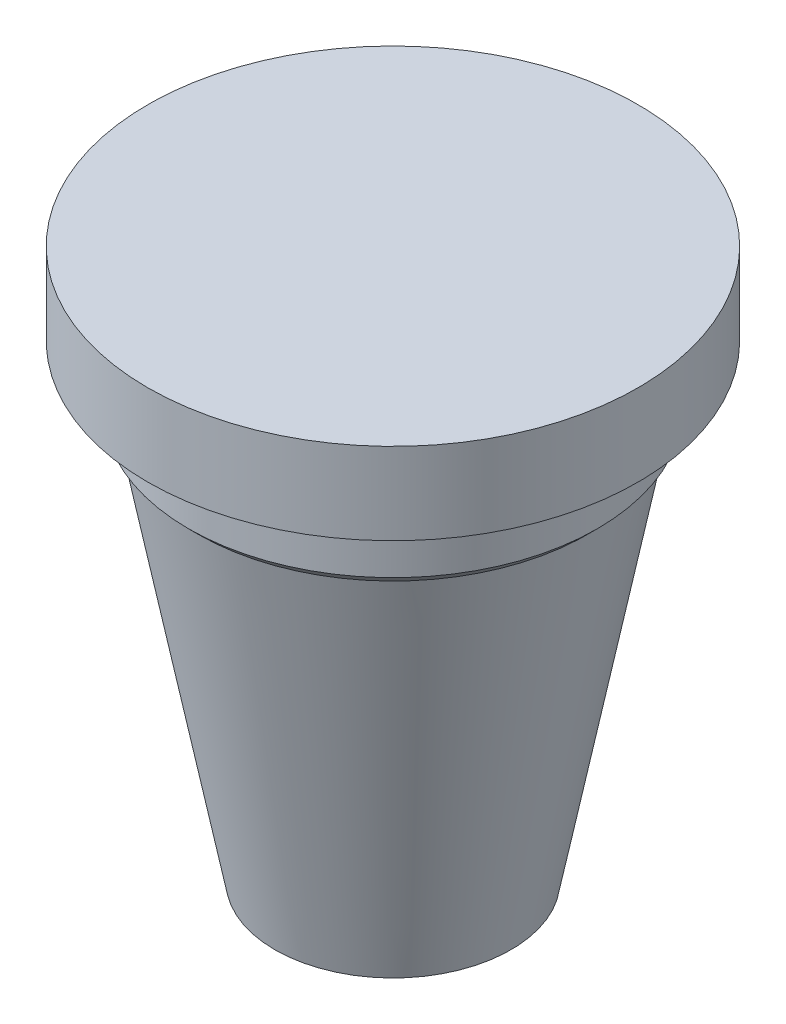
ISO-10303-21;
HEADER;
FILE_DESCRIPTION(('STEP AP214'),'2;1');
FILE_NAME('part.step','',(''),(''),'','','');
FILE_SCHEMA(('AUTOMOTIVE_DESIGN { 1 0 10303 214 1 1 1 1 }'));
ENDSEC;
DATA;
#1=APPLICATION_CONTEXT('core data for automotive mechanical design processes');
#2=APPLICATION_PROTOCOL_DEFINITION('international standard','automotive_design',2000,#1);
#3=PRODUCT_CONTEXT('',#1,'mechanical');
#4=PRODUCT('Part','Part','',(#3));
#5=PRODUCT_RELATED_PRODUCT_CATEGORY('part','',(#4));
#6=PRODUCT_DEFINITION_FORMATION('','',#4);
#7=PRODUCT_DEFINITION_CONTEXT('part definition',#1,'design');
#8=PRODUCT_DEFINITION('design','',#6,#7);
#9=PRODUCT_DEFINITION_SHAPE('','',#8);
#10=(LENGTH_UNIT() NAMED_UNIT(*) SI_UNIT(.MILLI.,.METRE.));
#11=(NAMED_UNIT(*) PLANE_ANGLE_UNIT() SI_UNIT($,.RADIAN.));
#12=(NAMED_UNIT(*) SI_UNIT($,.STERADIAN.) SOLID_ANGLE_UNIT());
#13=UNCERTAINTY_MEASURE_WITH_UNIT(LENGTH_MEASURE(1.E-05),#10,'distance_accuracy_value','');
#14=(GEOMETRIC_REPRESENTATION_CONTEXT(3) GLOBAL_UNCERTAINTY_ASSIGNED_CONTEXT((#13)) GLOBAL_UNIT_ASSIGNED_CONTEXT((#10,
#11,#12)) REPRESENTATION_CONTEXT('',''));
#15=CARTESIAN_POINT('',(0.,0.,0.));
#16=DIRECTION('',(0.,0.,1.));
#17=DIRECTION('',(1.,0.,0.));
#18=AXIS2_PLACEMENT_3D('',#15,#16,#17);
#19=CARTESIAN_POINT('',(0.,2.,0.));
#20=DIRECTION('',(0.,-1.,0.));
#21=DIRECTION('',(0.,0.,-1.));
#22=AXIS2_PLACEMENT_3D('',#19,#20,#21);
#23=PLANE('',#22);
#24=CARTESIAN_POINT('',(0.,2.,0.));
#25=DIRECTION('',(0.,-1.,0.));
#26=DIRECTION('',(0.,0.,-1.));
#27=AXIS2_PLACEMENT_3D('',#24,#25,#26);
#28=CIRCLE('',#27,21.6668554158657);
#29=CARTESIAN_POINT('',(0.,2.,-21.6668554158657));
#30=VERTEX_POINT('',#29);
#31=EDGE_CURVE('E55',#30,#30,#28,.T.);
#32=ORIENTED_EDGE('',*,*,#31,.T.);
#33=EDGE_LOOP('',(#32));
#34=FACE_BOUND('',#33,.T.);
#35=ADVANCED_FACE('F41',(#34),#23,.T.);
#36=CARTESIAN_POINT('',(0.,0.376395142507585,0.));
#37=DIRECTION('',(0.,1.,0.));
#38=DIRECTION('',(0.,0.,1.));
#39=AXIS2_PLACEMENT_3D('',#36,#37,#38);
#40=CONICAL_SURFACE('',#39,21.3557376202002,0.189326600712665);
#41=CARTESIAN_POINT('',(0.,74.9797878302453,0.));
#42=DIRECTION('',(0.,-1.,0.));
#43=DIRECTION('',(0.,0.,-1.));
#44=AXIS2_PLACEMENT_3D('',#41,#42,#43);
#45=CIRCLE('',#44,35.6513607054993);
#46=CARTESIAN_POINT('',(0.,74.9797878302453,-35.6513607054993));
#47=VERTEX_POINT('',#46);
#48=EDGE_CURVE('E49',#47,#47,#45,.T.);
#49=ORIENTED_EDGE('',*,*,#48,.T.);
#50=EDGE_LOOP('',(#49));
#51=FACE_BOUND('',#50,.T.);
#52=ORIENTED_EDGE('',*,*,#31,.F.);
#53=EDGE_LOOP('',(#52));
#54=FACE_BOUND('',#53,.T.);
#55=ADVANCED_FACE('F90',(#51,#54),#40,.T.);
#56=CARTESIAN_POINT('',(0.,75.4142135623731,0.));
#57=DIRECTION('',(0.,1.,0.));
#58=DIRECTION('',(0.,0.,1.));
#59=AXIS2_PLACEMENT_3D('',#56,#57,#58);
#60=CONICAL_SURFACE('',#59,36.0857864376271,0.785398163397447);
#61=CARTESIAN_POINT('',(0.,76.8284271247461,0.));
#62=DIRECTION('',(0.,1.,0.));
#63=DIRECTION('',(0.,0.,1.));
#64=AXIS2_PLACEMENT_3D('',#61,#62,#63);
#65=CIRCLE('',#64,37.5000000000001);
#66=CARTESIAN_POINT('',(0.,76.8284271247461,37.5000000000001));
#67=VERTEX_POINT('',#66);
#68=EDGE_CURVE('E10',#67,#67,#65,.F.);
#69=ORIENTED_EDGE('',*,*,#68,.T.);
#70=EDGE_LOOP('',(#69));
#71=FACE_BOUND('',#70,.T.);
#72=ORIENTED_EDGE('',*,*,#48,.F.);
#73=EDGE_LOOP('',(#72));
#74=FACE_BOUND('',#73,.T.);
#75=ADVANCED_FACE('F94',(#71,#74),#60,.T.);
#76=CARTESIAN_POINT('',(0.,0.,0.));
#77=DIRECTION('',(0.,-1.,0.));
#78=DIRECTION('',(0.,0.,-1.));
#79=AXIS2_PLACEMENT_3D('',#76,#77,#78);
#80=CYLINDRICAL_SURFACE('',#79,37.5000000000001);
#81=ORIENTED_EDGE('',*,*,#68,.F.);
#82=EDGE_LOOP('',(#81));
#83=FACE_BOUND('',#82,.T.);
#84=CARTESIAN_POINT('',(0.,88.,0.));
#85=DIRECTION('',(0.,-1.,0.));
#86=DIRECTION('',(0.,0.,-1.));
#87=AXIS2_PLACEMENT_3D('',#84,#85,#86);
#88=CIRCLE('',#87,37.5000000000001);
#89=CARTESIAN_POINT('',(0.,88.,-37.5000000000001));
#90=VERTEX_POINT('',#89);
#91=EDGE_CURVE('E44',#90,#90,#88,.T.);
#92=ORIENTED_EDGE('',*,*,#91,.T.);
#93=EDGE_LOOP('',(#92));
#94=FACE_BOUND('',#93,.T.);
#95=ADVANCED_FACE('F99',(#83,#94),#80,.T.);
#96=CARTESIAN_POINT('',(0.,103.,0.));
#97=DIRECTION('',(0.,-1.,0.));
#98=DIRECTION('',(0.,0.,-1.));
#99=AXIS2_PLACEMENT_3D('',#96,#97,#98);
#100=CYLINDRICAL_SURFACE('',#99,45.);
#101=CARTESIAN_POINT('',(0.,103.,0.));
#102=DIRECTION('',(0.,1.,0.));
#103=DIRECTION('',(0.,0.,1.));
#104=AXIS2_PLACEMENT_3D('',#101,#102,#103);
#105=CIRCLE('',#104,45.);
#106=CARTESIAN_POINT('',(0.,103.,45.));
#107=VERTEX_POINT('',#106);
#108=EDGE_CURVE('E66',#107,#107,#105,.T.);
#109=ORIENTED_EDGE('',*,*,#108,.F.);
#110=EDGE_LOOP('',(#109));
#111=FACE_BOUND('',#110,.T.);
#112=CARTESIAN_POINT('',(0.,88.,0.));
#113=DIRECTION('',(0.,1.,0.));
#114=DIRECTION('',(0.,0.,1.));
#115=AXIS2_PLACEMENT_3D('',#112,#113,#114);
#116=CIRCLE('',#115,45.);
#117=CARTESIAN_POINT('',(0.,88.,45.));
#118=VERTEX_POINT('',#117);
#119=EDGE_CURVE('E58',#118,#118,#116,.T.);
#120=ORIENTED_EDGE('',*,*,#119,.T.);
#121=EDGE_LOOP('',(#120));
#122=FACE_BOUND('',#121,.T.);
#123=ADVANCED_FACE('F77',(#111,#122),#100,.T.);
#124=CARTESIAN_POINT('',(0.,103.,0.));
#125=DIRECTION('',(0.,1.,0.));
#126=DIRECTION('',(0.,0.,1.));
#127=AXIS2_PLACEMENT_3D('',#124,#125,#126);
#128=PLANE('',#127);
#129=ORIENTED_EDGE('',*,*,#108,.T.);
#130=EDGE_LOOP('',(#129));
#131=FACE_BOUND('',#130,.T.);
#132=ADVANCED_FACE('F81',(#131),#128,.T.);
#133=CARTESIAN_POINT('',(0.,88.,0.));
#134=DIRECTION('',(0.,1.,0.));
#135=DIRECTION('',(0.,0.,1.));
#136=AXIS2_PLACEMENT_3D('',#133,#134,#135);
#137=PLANE('',#136);
#138=ORIENTED_EDGE('',*,*,#91,.F.);
#139=EDGE_LOOP('',(#138));
#140=FACE_BOUND('',#139,.T.);
#141=ORIENTED_EDGE('',*,*,#119,.F.);
#142=EDGE_LOOP('',(#141));
#143=FACE_BOUND('',#142,.T.);
#144=ADVANCED_FACE('F79',(#140,#143),#137,.F.);
#145=CLOSED_SHELL('',(#35,#55,#75,#95,#123,#132,#144));
#146=MANIFOLD_SOLID_BREP('B2',#145);
#147=ADVANCED_BREP_SHAPE_REPRESENTATION('',(#18,#146),#14);
#148=SHAPE_DEFINITION_REPRESENTATION(#9,#147);
ENDSEC;
END-ISO-10303-21;
